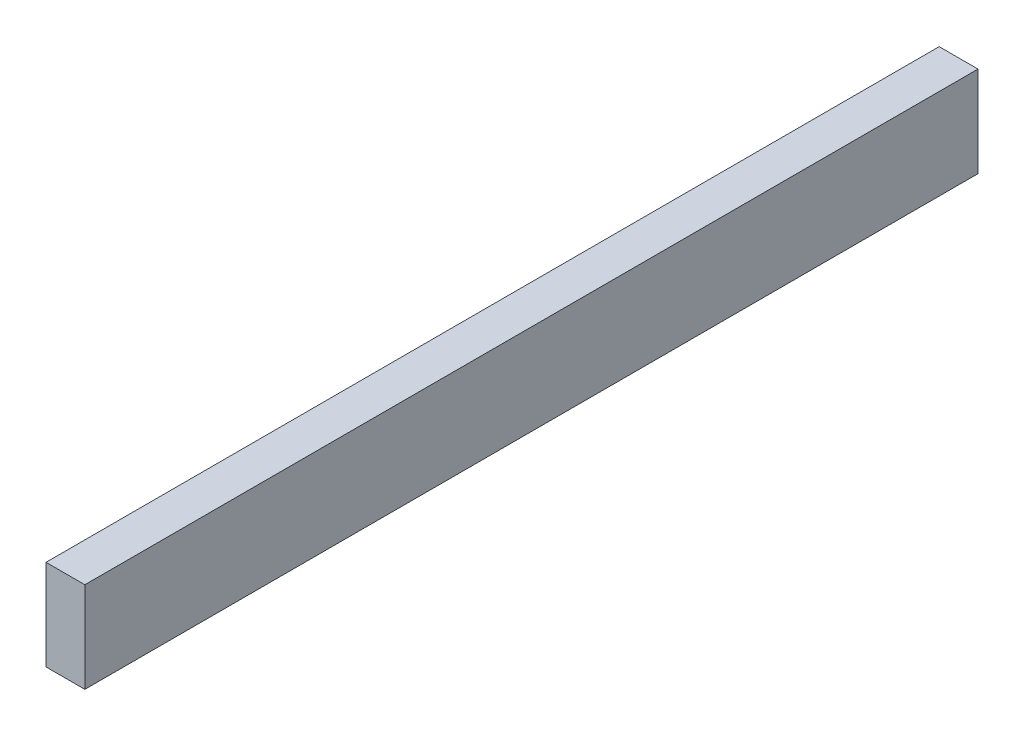
ISO-10303-21;
HEADER;
FILE_DESCRIPTION(('STEP AP214'),'2;1');
FILE_NAME('part.step','',(''),(''),'','','');
FILE_SCHEMA(('AUTOMOTIVE_DESIGN { 1 0 10303 214 1 1 1 1 }'));
ENDSEC;
DATA;
#1=APPLICATION_CONTEXT('core data for automotive mechanical design processes');
#2=APPLICATION_PROTOCOL_DEFINITION('international standard','automotive_design',2000,#1);
#3=PRODUCT_CONTEXT('',#1,'mechanical');
#4=PRODUCT('Part','Part','',(#3));
#5=PRODUCT_RELATED_PRODUCT_CATEGORY('part','',(#4));
#6=PRODUCT_DEFINITION_FORMATION('','',#4);
#7=PRODUCT_DEFINITION_CONTEXT('part definition',#1,'design');
#8=PRODUCT_DEFINITION('design','',#6,#7);
#9=PRODUCT_DEFINITION_SHAPE('','',#8);
#10=(LENGTH_UNIT() NAMED_UNIT(*) SI_UNIT(.MILLI.,.METRE.));
#11=(NAMED_UNIT(*) PLANE_ANGLE_UNIT() SI_UNIT($,.RADIAN.));
#12=(NAMED_UNIT(*) SI_UNIT($,.STERADIAN.) SOLID_ANGLE_UNIT());
#13=UNCERTAINTY_MEASURE_WITH_UNIT(LENGTH_MEASURE(1.E-05),#10,'distance_accuracy_value','');
#14=(GEOMETRIC_REPRESENTATION_CONTEXT(3) GLOBAL_UNCERTAINTY_ASSIGNED_CONTEXT((#13)) GLOBAL_UNIT_ASSIGNED_CONTEXT((#10,
#11,#12)) REPRESENTATION_CONTEXT('',''));
#15=CARTESIAN_POINT('',(0.,0.,0.));
#16=DIRECTION('',(0.,0.,1.));
#17=DIRECTION('',(1.,0.,0.));
#18=AXIS2_PLACEMENT_3D('',#15,#16,#17);
#19=CARTESIAN_POINT('',(19.0500000000004,-44.45,876.3));
#20=DIRECTION('',(-1.,0.,0.));
#21=DIRECTION('',(0.,0.,1.));
#22=AXIS2_PLACEMENT_3D('',#19,#20,#21);
#23=PLANE('',#22);
#24=DIRECTION('',(0.,1.,0.));
#25=VECTOR('',#24,1.);
#26=CARTESIAN_POINT('',(19.05,-44.45,0.));
#27=LINE('',#26,#25);
#28=CARTESIAN_POINT('',(19.05,-44.45,0.));
#29=VERTEX_POINT('',#28);
#30=CARTESIAN_POINT('',(19.05,44.45,0.));
#31=VERTEX_POINT('',#30);
#32=EDGE_CURVE('E103',#29,#31,#27,.T.);
#33=ORIENTED_EDGE('',*,*,#32,.T.);
#34=DIRECTION('',(0.,0.,-1.));
#35=VECTOR('',#34,1.);
#36=CARTESIAN_POINT('',(19.0500000000004,44.45,876.3));
#37=LINE('',#36,#35);
#38=CARTESIAN_POINT('',(19.0500000000004,44.45,876.3));
#39=VERTEX_POINT('',#38);
#40=EDGE_CURVE('E11',#39,#31,#37,.T.);
#41=ORIENTED_EDGE('',*,*,#40,.F.);
#42=DIRECTION('',(0.,1.,0.));
#43=VECTOR('',#42,1.);
#44=CARTESIAN_POINT('',(19.0500000000004,-44.45,876.3));
#45=LINE('',#44,#43);
#46=CARTESIAN_POINT('',(19.0500000000004,-44.45,876.3));
#47=VERTEX_POINT('',#46);
#48=EDGE_CURVE('E86',#47,#39,#45,.T.);
#49=ORIENTED_EDGE('',*,*,#48,.F.);
#50=DIRECTION('',(0.,0.,-1.));
#51=VECTOR('',#50,1.);
#52=CARTESIAN_POINT('',(19.0500000000004,-44.45,876.3));
#53=LINE('',#52,#51);
#54=EDGE_CURVE('E99',#47,#29,#53,.T.);
#55=ORIENTED_EDGE('',*,*,#54,.T.);
#56=EDGE_LOOP('',(#33,#41,#49,#55));
#57=FACE_BOUND('',#56,.T.);
#58=ADVANCED_FACE('F34',(#57),#23,.F.);
#59=CARTESIAN_POINT('',(-19.0499999999996,44.45,876.3));
#60=DIRECTION('',(0.,-1.,0.));
#61=DIRECTION('',(0.,0.,-1.));
#62=AXIS2_PLACEMENT_3D('',#59,#60,#61);
#63=PLANE('',#62);
#64=DIRECTION('',(-1.,0.,0.));
#65=VECTOR('',#64,1.);
#66=CARTESIAN_POINT('',(-19.05,44.45,0.));
#67=LINE('',#66,#65);
#68=CARTESIAN_POINT('',(-19.05,44.45,0.));
#69=VERTEX_POINT('',#68);
#70=EDGE_CURVE('E91',#31,#69,#67,.T.);
#71=ORIENTED_EDGE('',*,*,#70,.T.);
#72=DIRECTION('',(0.,0.,-1.));
#73=VECTOR('',#72,1.);
#74=CARTESIAN_POINT('',(-19.0499999999996,44.45,876.3));
#75=LINE('',#74,#73);
#76=CARTESIAN_POINT('',(-19.0499999999996,44.45,876.3));
#77=VERTEX_POINT('',#76);
#78=EDGE_CURVE('E43',#77,#69,#75,.T.);
#79=ORIENTED_EDGE('',*,*,#78,.F.);
#80=DIRECTION('',(-1.,0.,0.));
#81=VECTOR('',#80,1.);
#82=CARTESIAN_POINT('',(-19.0499999999996,44.45,876.3));
#83=LINE('',#82,#81);
#84=EDGE_CURVE('E81',#39,#77,#83,.T.);
#85=ORIENTED_EDGE('',*,*,#84,.F.);
#86=ORIENTED_EDGE('',*,*,#40,.T.);
#87=EDGE_LOOP('',(#71,#79,#85,#86));
#88=FACE_BOUND('',#87,.T.);
#89=ADVANCED_FACE('F90',(#88),#63,.F.);
#90=CARTESIAN_POINT('',(-19.0499999999996,-44.45,876.3));
#91=DIRECTION('',(1.,0.,0.));
#92=DIRECTION('',(0.,0.,-1.));
#93=AXIS2_PLACEMENT_3D('',#90,#91,#92);
#94=PLANE('',#93);
#95=DIRECTION('',(0.,-1.,0.));
#96=VECTOR('',#95,1.);
#97=CARTESIAN_POINT('',(-19.05,-44.45,0.));
#98=LINE('',#97,#96);
#99=CARTESIAN_POINT('',(-19.05,-44.45,0.));
#100=VERTEX_POINT('',#99);
#101=EDGE_CURVE('E68',#69,#100,#98,.T.);
#102=ORIENTED_EDGE('',*,*,#101,.T.);
#103=DIRECTION('',(0.,0.,-1.));
#104=VECTOR('',#103,1.);
#105=CARTESIAN_POINT('',(-19.0499999999996,-44.45,876.3));
#106=LINE('',#105,#104);
#107=CARTESIAN_POINT('',(-19.0499999999996,-44.45,876.3));
#108=VERTEX_POINT('',#107);
#109=EDGE_CURVE('E93',#108,#100,#106,.T.);
#110=ORIENTED_EDGE('',*,*,#109,.F.);
#111=DIRECTION('',(0.,-1.,0.));
#112=VECTOR('',#111,1.);
#113=CARTESIAN_POINT('',(-19.0499999999996,-44.45,876.3));
#114=LINE('',#113,#112);
#115=EDGE_CURVE('E84',#77,#108,#114,.T.);
#116=ORIENTED_EDGE('',*,*,#115,.F.);
#117=ORIENTED_EDGE('',*,*,#78,.T.);
#118=EDGE_LOOP('',(#102,#110,#116,#117));
#119=FACE_BOUND('',#118,.T.);
#120=ADVANCED_FACE('F94',(#119),#94,.F.);
#121=CARTESIAN_POINT('',(-19.0499999999996,-44.45,876.3));
#122=DIRECTION('',(0.,1.,0.));
#123=DIRECTION('',(0.,0.,1.));
#124=AXIS2_PLACEMENT_3D('',#121,#122,#123);
#125=PLANE('',#124);
#126=DIRECTION('',(1.,0.,0.));
#127=VECTOR('',#126,1.);
#128=CARTESIAN_POINT('',(-19.05,-44.45,0.));
#129=LINE('',#128,#127);
#130=EDGE_CURVE('E74',#100,#29,#129,.T.);
#131=ORIENTED_EDGE('',*,*,#130,.T.);
#132=ORIENTED_EDGE('',*,*,#54,.F.);
#133=DIRECTION('',(1.,0.,0.));
#134=VECTOR('',#133,1.);
#135=CARTESIAN_POINT('',(-19.0499999999996,-44.45,876.3));
#136=LINE('',#135,#134);
#137=EDGE_CURVE('E51',#108,#47,#136,.T.);
#138=ORIENTED_EDGE('',*,*,#137,.F.);
#139=ORIENTED_EDGE('',*,*,#109,.T.);
#140=EDGE_LOOP('',(#131,#132,#138,#139));
#141=FACE_BOUND('',#140,.T.);
#142=ADVANCED_FACE('F117',(#141),#125,.F.);
#143=CARTESIAN_POINT('',(4.37150315946155E-13,0.,876.3));
#144=DIRECTION('',(0.,0.,-1.));
#145=DIRECTION('',(-1.,0.,0.));
#146=AXIS2_PLACEMENT_3D('',#143,#144,#145);
#147=PLANE('',#146);
#148=ORIENTED_EDGE('',*,*,#48,.T.);
#149=ORIENTED_EDGE('',*,*,#84,.T.);
#150=ORIENTED_EDGE('',*,*,#115,.T.);
#151=ORIENTED_EDGE('',*,*,#137,.T.);
#152=EDGE_LOOP('',(#148,#149,#150,#151));
#153=FACE_BOUND('',#152,.T.);
#154=ADVANCED_FACE('F82',(#153),#147,.F.);
#155=CARTESIAN_POINT('',(0.,0.,0.));
#156=DIRECTION('',(0.,0.,-1.));
#157=DIRECTION('',(-1.,0.,0.));
#158=AXIS2_PLACEMENT_3D('',#155,#156,#157);
#159=PLANE('',#158);
#160=ORIENTED_EDGE('',*,*,#32,.F.);
#161=ORIENTED_EDGE('',*,*,#130,.F.);
#162=ORIENTED_EDGE('',*,*,#101,.F.);
#163=ORIENTED_EDGE('',*,*,#70,.F.);
#164=EDGE_LOOP('',(#160,#161,#162,#163));
#165=FACE_BOUND('',#164,.T.);
#166=ADVANCED_FACE('F120',(#165),#159,.T.);
#167=CLOSED_SHELL('',(#58,#89,#120,#142,#154,#166));
#168=MANIFOLD_SOLID_BREP('B2',#167);
#169=ADVANCED_BREP_SHAPE_REPRESENTATION('',(#18,#168),#14);
#170=SHAPE_DEFINITION_REPRESENTATION(#9,#169);
ENDSEC;
END-ISO-10303-21;
